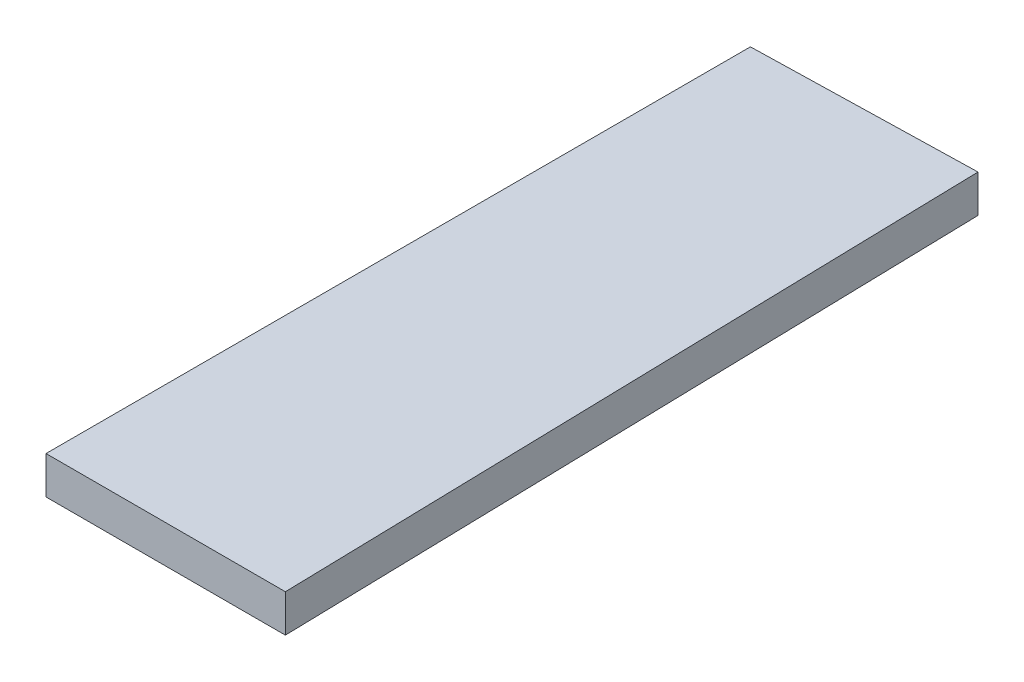
ISO-10303-21;
HEADER;
FILE_DESCRIPTION(('STEP AP214'),'2;1');
FILE_NAME('part.step','',(''),(''),'','','');
FILE_SCHEMA(('AUTOMOTIVE_DESIGN { 1 0 10303 214 1 1 1 1 }'));
ENDSEC;
DATA;
#1=APPLICATION_CONTEXT('core data for automotive mechanical design processes');
#2=APPLICATION_PROTOCOL_DEFINITION('international standard','automotive_design',2000,#1);
#3=PRODUCT_CONTEXT('',#1,'mechanical');
#4=PRODUCT('Part','Part','',(#3));
#5=PRODUCT_RELATED_PRODUCT_CATEGORY('part','',(#4));
#6=PRODUCT_DEFINITION_FORMATION('','',#4);
#7=PRODUCT_DEFINITION_CONTEXT('part definition',#1,'design');
#8=PRODUCT_DEFINITION('design','',#6,#7);
#9=PRODUCT_DEFINITION_SHAPE('','',#8);
#10=(LENGTH_UNIT() NAMED_UNIT(*) SI_UNIT(.MILLI.,.METRE.));
#11=(NAMED_UNIT(*) PLANE_ANGLE_UNIT() SI_UNIT($,.RADIAN.));
#12=(NAMED_UNIT(*) SI_UNIT($,.STERADIAN.) SOLID_ANGLE_UNIT());
#13=UNCERTAINTY_MEASURE_WITH_UNIT(LENGTH_MEASURE(1.E-05),#10,'distance_accuracy_value','');
#14=(GEOMETRIC_REPRESENTATION_CONTEXT(3) GLOBAL_UNCERTAINTY_ASSIGNED_CONTEXT((#13)) GLOBAL_UNIT_ASSIGNED_CONTEXT((#10,
#11,#12)) REPRESENTATION_CONTEXT('',''));
#15=CARTESIAN_POINT('',(0.,0.,0.));
#16=DIRECTION('',(0.,0.,1.));
#17=DIRECTION('',(1.,0.,0.));
#18=AXIS2_PLACEMENT_3D('',#15,#16,#17);
#19=CARTESIAN_POINT('',(0.,2.,-37.4398964231105));
#20=DIRECTION('',(1.,0.,0.));
#21=DIRECTION('',(0.,0.,-1.));
#22=AXIS2_PLACEMENT_3D('',#19,#20,#21);
#23=PLANE('',#22);
#24=DIRECTION('',(0.,0.,1.));
#25=VECTOR('',#24,1.);
#26=CARTESIAN_POINT('',(0.,0.,-37.4398964231105));
#27=LINE('',#26,#25);
#28=CARTESIAN_POINT('',(0.,0.,-37.4398964231105));
#29=VERTEX_POINT('',#28);
#30=CARTESIAN_POINT('',(0.,0.,0.));
#31=VERTEX_POINT('',#30);
#32=EDGE_CURVE('E107',#29,#31,#27,.T.);
#33=ORIENTED_EDGE('',*,*,#32,.T.);
#34=DIRECTION('',(0.,-1.,0.));
#35=VECTOR('',#34,1.);
#36=CARTESIAN_POINT('',(0.,2.,0.));
#37=LINE('',#36,#35);
#38=CARTESIAN_POINT('',(0.,2.,0.));
#39=VERTEX_POINT('',#38);
#40=EDGE_CURVE('E11',#39,#31,#37,.T.);
#41=ORIENTED_EDGE('',*,*,#40,.F.);
#42=DIRECTION('',(0.,0.,1.));
#43=VECTOR('',#42,1.);
#44=CARTESIAN_POINT('',(0.,2.,-37.4398964231105));
#45=LINE('',#44,#43);
#46=CARTESIAN_POINT('',(0.,2.,-37.4398964231105));
#47=VERTEX_POINT('',#46);
#48=EDGE_CURVE('E91',#47,#39,#45,.T.);
#49=ORIENTED_EDGE('',*,*,#48,.F.);
#50=DIRECTION('',(0.,-1.,0.));
#51=VECTOR('',#50,1.);
#52=CARTESIAN_POINT('',(0.,2.,-37.4398964231105));
#53=LINE('',#52,#51);
#54=EDGE_CURVE('E103',#47,#29,#53,.T.);
#55=ORIENTED_EDGE('',*,*,#54,.T.);
#56=EDGE_LOOP('',(#33,#41,#49,#55));
#57=FACE_BOUND('',#56,.T.);
#58=ADVANCED_FACE('F39',(#57),#23,.F.);
#59=CARTESIAN_POINT('',(0.,2.,0.));
#60=DIRECTION('',(1.67878199985759E-06,0.,-0.999999999998591));
#61=DIRECTION('',(-0.999999999998591,0.,-1.67878199985759E-06));
#62=AXIS2_PLACEMENT_3D('',#59,#60,#61);
#63=PLANE('',#62);
#64=DIRECTION('',(0.999999999998591,0.,1.67878199985759E-06));
#65=VECTOR('',#64,1.);
#66=CARTESIAN_POINT('',(0.,0.,0.));
#67=LINE('',#66,#65);
#68=CARTESIAN_POINT('',(12.7235032159166,0.,2.13599881740412E-05));
#69=VERTEX_POINT('',#68);
#70=EDGE_CURVE('E96',#31,#69,#67,.T.);
#71=ORIENTED_EDGE('',*,*,#70,.T.);
#72=DIRECTION('',(0.,-1.,0.));
#73=VECTOR('',#72,1.);
#74=CARTESIAN_POINT('',(12.7235032159166,2.,2.13599881740412E-05));
#75=LINE('',#74,#73);
#76=CARTESIAN_POINT('',(12.7235032159166,2.,2.13599881740412E-05));
#77=VERTEX_POINT('',#76);
#78=EDGE_CURVE('E48',#77,#69,#75,.T.);
#79=ORIENTED_EDGE('',*,*,#78,.F.);
#80=DIRECTION('',(0.999999999998591,0.,1.67878199985759E-06));
#81=VECTOR('',#80,1.);
#82=CARTESIAN_POINT('',(0.,2.,0.));
#83=LINE('',#82,#81);
#84=EDGE_CURVE('E86',#39,#77,#83,.T.);
#85=ORIENTED_EDGE('',*,*,#84,.F.);
#86=ORIENTED_EDGE('',*,*,#40,.T.);
#87=EDGE_LOOP('',(#71,#79,#85,#86));
#88=FACE_BOUND('',#87,.T.);
#89=ADVANCED_FACE('F95',(#88),#63,.F.);
#90=CARTESIAN_POINT('',(12.7235032159166,2.,2.13599881740412E-05));
#91=DIRECTION('',(-0.999707271278936,0.,0.0241944570516599));
#92=DIRECTION('',(0.0241944570516599,0.,0.999707271278936));
#93=AXIS2_PLACEMENT_3D('',#90,#91,#92);
#94=PLANE('',#93);
#95=DIRECTION('',(-0.0241944570516599,0.,-0.999707271278936));
#96=VECTOR('',#95,1.);
#97=CARTESIAN_POINT('',(12.7235032159166,0.,2.13599881740412E-05));
#98=LINE('',#97,#96);
#99=CARTESIAN_POINT('',(11.810481918667,0.,-37.7257282918485));
#100=VERTEX_POINT('',#99);
#101=EDGE_CURVE('E73',#69,#100,#98,.T.);
#102=ORIENTED_EDGE('',*,*,#101,.T.);
#103=DIRECTION('',(0.,-1.,0.));
#104=VECTOR('',#103,1.);
#105=CARTESIAN_POINT('',(11.810481918667,2.,-37.7257282918485));
#106=LINE('',#105,#104);
#107=CARTESIAN_POINT('',(11.810481918667,2.,-37.7257282918485));
#108=VERTEX_POINT('',#107);
#109=EDGE_CURVE('E98',#108,#100,#106,.T.);
#110=ORIENTED_EDGE('',*,*,#109,.F.);
#111=DIRECTION('',(-0.0241944570516599,0.,-0.999707271278936));
#112=VECTOR('',#111,1.);
#113=CARTESIAN_POINT('',(12.7235032159166,2.,2.13599881740412E-05));
#114=LINE('',#113,#112);
#115=EDGE_CURVE('E89',#77,#108,#114,.T.);
#116=ORIENTED_EDGE('',*,*,#115,.F.);
#117=ORIENTED_EDGE('',*,*,#78,.T.);
#118=EDGE_LOOP('',(#102,#110,#116,#117));
#119=FACE_BOUND('',#118,.T.);
#120=ADVANCED_FACE('F99',(#119),#94,.F.);
#121=CARTESIAN_POINT('',(11.810481918667,2.,-37.7257282918485));
#122=DIRECTION('',(0.0241944570516618,0.,0.999707271278936));
#123=DIRECTION('',(0.999707271278936,0.,-0.0241944570516618));
#124=AXIS2_PLACEMENT_3D('',#121,#122,#123);
#125=PLANE('',#124);
#126=DIRECTION('',(-0.999707271278936,0.,0.0241944570516618));
#127=VECTOR('',#126,1.);
#128=CARTESIAN_POINT('',(11.810481918667,0.,-37.7257282918485));
#129=LINE('',#128,#127);
#130=EDGE_CURVE('E79',#100,#29,#129,.T.);
#131=ORIENTED_EDGE('',*,*,#130,.T.);
#132=ORIENTED_EDGE('',*,*,#54,.F.);
#133=DIRECTION('',(-0.999707271278936,0.,0.0241944570516618));
#134=VECTOR('',#133,1.);
#135=CARTESIAN_POINT('',(11.810481918667,2.,-37.7257282918485));
#136=LINE('',#135,#134);
#137=EDGE_CURVE('E56',#108,#47,#136,.T.);
#138=ORIENTED_EDGE('',*,*,#137,.F.);
#139=ORIENTED_EDGE('',*,*,#109,.T.);
#140=EDGE_LOOP('',(#131,#132,#138,#139));
#141=FACE_BOUND('',#140,.T.);
#142=ADVANCED_FACE('F120',(#141),#125,.F.);
#143=CARTESIAN_POINT('',(0.,2.,0.));
#144=DIRECTION('',(0.,1.,0.));
#145=DIRECTION('',(0.,0.,1.));
#146=AXIS2_PLACEMENT_3D('',#143,#144,#145);
#147=PLANE('',#146);
#148=ORIENTED_EDGE('',*,*,#48,.T.);
#149=ORIENTED_EDGE('',*,*,#84,.T.);
#150=ORIENTED_EDGE('',*,*,#115,.T.);
#151=ORIENTED_EDGE('',*,*,#137,.T.);
#152=EDGE_LOOP('',(#148,#149,#150,#151));
#153=FACE_BOUND('',#152,.T.);
#154=ADVANCED_FACE('F87',(#153),#147,.T.);
#155=CARTESIAN_POINT('',(0.,0.,0.));
#156=DIRECTION('',(0.,1.,0.));
#157=DIRECTION('',(0.,0.,1.));
#158=AXIS2_PLACEMENT_3D('',#155,#156,#157);
#159=PLANE('',#158);
#160=ORIENTED_EDGE('',*,*,#32,.F.);
#161=ORIENTED_EDGE('',*,*,#130,.F.);
#162=ORIENTED_EDGE('',*,*,#101,.F.);
#163=ORIENTED_EDGE('',*,*,#70,.F.);
#164=EDGE_LOOP('',(#160,#161,#162,#163));
#165=FACE_BOUND('',#164,.T.);
#166=ADVANCED_FACE('F123',(#165),#159,.F.);
#167=CLOSED_SHELL('',(#58,#89,#120,#142,#154,#166));
#168=MANIFOLD_SOLID_BREP('B2',#167);
#169=ADVANCED_BREP_SHAPE_REPRESENTATION('',(#18,#168),#14);
#170=SHAPE_DEFINITION_REPRESENTATION(#9,#169);
ENDSEC;
END-ISO-10303-21;
